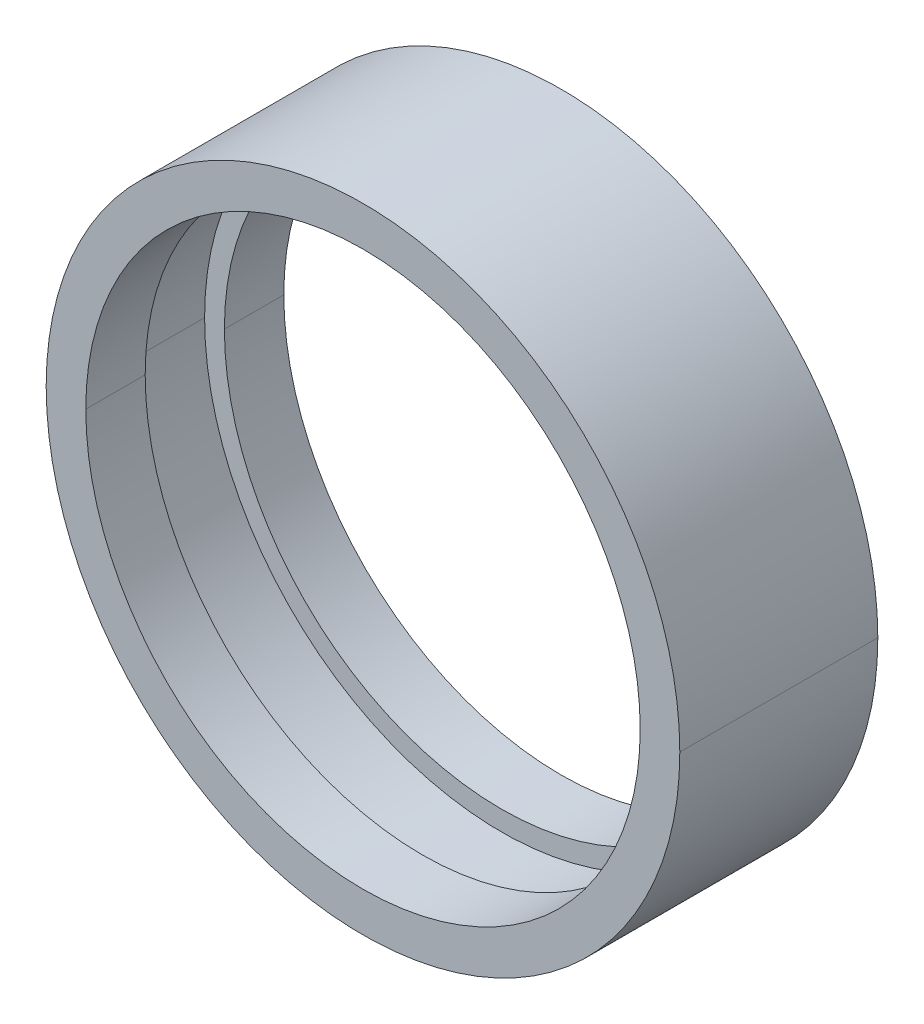
ISO-10303-21;
HEADER;
FILE_DESCRIPTION(('STEP AP214'),'2;1');
FILE_NAME('part.step','',(''),(''),'','','');
FILE_SCHEMA(('AUTOMOTIVE_DESIGN { 1 0 10303 214 1 1 1 1 }'));
ENDSEC;
DATA;
#1=APPLICATION_CONTEXT('core data for automotive mechanical design processes');
#2=APPLICATION_PROTOCOL_DEFINITION('international standard','automotive_design',2000,#1);
#3=PRODUCT_CONTEXT('',#1,'mechanical');
#4=PRODUCT('Part','Part','',(#3));
#5=PRODUCT_RELATED_PRODUCT_CATEGORY('part','',(#4));
#6=PRODUCT_DEFINITION_FORMATION('','',#4);
#7=PRODUCT_DEFINITION_CONTEXT('part definition',#1,'design');
#8=PRODUCT_DEFINITION('design','',#6,#7);
#9=PRODUCT_DEFINITION_SHAPE('','',#8);
#10=(LENGTH_UNIT() NAMED_UNIT(*) SI_UNIT(.MILLI.,.METRE.));
#11=(NAMED_UNIT(*) PLANE_ANGLE_UNIT() SI_UNIT($,.RADIAN.));
#12=(NAMED_UNIT(*) SI_UNIT($,.STERADIAN.) SOLID_ANGLE_UNIT());
#13=UNCERTAINTY_MEASURE_WITH_UNIT(LENGTH_MEASURE(1.E-05),#10,'distance_accuracy_value','');
#14=(GEOMETRIC_REPRESENTATION_CONTEXT(3) GLOBAL_UNCERTAINTY_ASSIGNED_CONTEXT((#13)) GLOBAL_UNIT_ASSIGNED_CONTEXT((#10,
#11,#12)) REPRESENTATION_CONTEXT('',''));
#15=CARTESIAN_POINT('',(0.,0.,0.));
#16=DIRECTION('',(0.,0.,1.));
#17=DIRECTION('',(1.,0.,0.));
#18=AXIS2_PLACEMENT_3D('',#15,#16,#17);
#19=CARTESIAN_POINT('',(0.,0.,0.5));
#20=DIRECTION('',(0.,0.,1.));
#21=DIRECTION('',(1.,0.,0.));
#22=AXIS2_PLACEMENT_3D('',#19,#20,#21);
#23=PLANE('',#22);
#24=CARTESIAN_POINT('',(0.,0.,0.5));
#25=DIRECTION('',(0.,0.,1.));
#26=DIRECTION('',(1.,0.,0.));
#27=AXIS2_PLACEMENT_3D('',#24,#25,#26);
#28=CIRCLE('',#27,3.5);
#29=CARTESIAN_POINT('',(-3.5,0.,0.5));
#30=VERTEX_POINT('',#29);
#31=CARTESIAN_POINT('',(3.5,0.,0.5));
#32=VERTEX_POINT('',#31);
#33=EDGE_CURVE('E113',#30,#32,#28,.T.);
#34=ORIENTED_EDGE('',*,*,#33,.T.);
#35=CARTESIAN_POINT('',(0.,0.,0.5));
#36=DIRECTION('',(0.,0.,1.));
#37=DIRECTION('',(1.,0.,0.));
#38=AXIS2_PLACEMENT_3D('',#35,#36,#37);
#39=CIRCLE('',#38,3.5);
#40=EDGE_CURVE('E161',#32,#30,#39,.T.);
#41=ORIENTED_EDGE('',*,*,#40,.T.);
#42=EDGE_LOOP('',(#34,#41));
#43=FACE_BOUND('',#42,.T.);
#44=CARTESIAN_POINT('',(0.,0.,0.5));
#45=DIRECTION('',(0.,0.,1.));
#46=DIRECTION('',(1.,0.,0.));
#47=AXIS2_PLACEMENT_3D('',#44,#45,#46);
#48=CIRCLE('',#47,3.75);
#49=CARTESIAN_POINT('',(3.75,0.,0.5));
#50=VERTEX_POINT('',#49);
#51=CARTESIAN_POINT('',(-3.75,0.,0.5));
#52=VERTEX_POINT('',#51);
#53=EDGE_CURVE('E11',#50,#52,#48,.T.);
#54=ORIENTED_EDGE('',*,*,#53,.F.);
#55=CARTESIAN_POINT('',(0.,0.,0.5));
#56=DIRECTION('',(0.,0.,1.));
#57=DIRECTION('',(1.,0.,0.));
#58=AXIS2_PLACEMENT_3D('',#55,#56,#57);
#59=CIRCLE('',#58,3.75);
#60=EDGE_CURVE('E129',#52,#50,#59,.T.);
#61=ORIENTED_EDGE('',*,*,#60,.F.);
#62=EDGE_LOOP('',(#54,#61));
#63=FACE_BOUND('',#62,.T.);
#64=ADVANCED_FACE('F17',(#43,#63),#23,.F.);
#65=CARTESIAN_POINT('',(0.,0.,-0.5));
#66=DIRECTION('',(0.,0.,1.));
#67=DIRECTION('',(1.,0.,0.));
#68=AXIS2_PLACEMENT_3D('',#65,#66,#67);
#69=PLANE('',#68);
#70=CARTESIAN_POINT('',(0.,0.,-0.5));
#71=DIRECTION('',(0.,0.,1.));
#72=DIRECTION('',(1.,0.,0.));
#73=AXIS2_PLACEMENT_3D('',#70,#71,#72);
#74=CIRCLE('',#73,3.5);
#75=CARTESIAN_POINT('',(-3.5,0.,-0.5));
#76=VERTEX_POINT('',#75);
#77=CARTESIAN_POINT('',(3.5,0.,-0.5));
#78=VERTEX_POINT('',#77);
#79=EDGE_CURVE('E166',#76,#78,#74,.T.);
#80=ORIENTED_EDGE('',*,*,#79,.F.);
#81=CARTESIAN_POINT('',(0.,0.,-0.5));
#82=DIRECTION('',(0.,0.,1.));
#83=DIRECTION('',(1.,0.,0.));
#84=AXIS2_PLACEMENT_3D('',#81,#82,#83);
#85=CIRCLE('',#84,3.5);
#86=EDGE_CURVE('E149',#78,#76,#85,.T.);
#87=ORIENTED_EDGE('',*,*,#86,.F.);
#88=EDGE_LOOP('',(#80,#87));
#89=FACE_BOUND('',#88,.T.);
#90=CARTESIAN_POINT('',(0.,0.,-0.5));
#91=DIRECTION('',(0.,0.,1.));
#92=DIRECTION('',(1.,0.,0.));
#93=AXIS2_PLACEMENT_3D('',#90,#91,#92);
#94=CIRCLE('',#93,3.75);
#95=CARTESIAN_POINT('',(3.75,0.,-0.5));
#96=VERTEX_POINT('',#95);
#97=CARTESIAN_POINT('',(-3.75,0.,-0.5));
#98=VERTEX_POINT('',#97);
#99=EDGE_CURVE('E27',#96,#98,#94,.T.);
#100=ORIENTED_EDGE('',*,*,#99,.T.);
#101=CARTESIAN_POINT('',(0.,0.,-0.5));
#102=DIRECTION('',(0.,0.,1.));
#103=DIRECTION('',(1.,0.,0.));
#104=AXIS2_PLACEMENT_3D('',#101,#102,#103);
#105=CIRCLE('',#104,3.75);
#106=EDGE_CURVE('E137',#98,#96,#105,.T.);
#107=ORIENTED_EDGE('',*,*,#106,.T.);
#108=EDGE_LOOP('',(#100,#107));
#109=FACE_BOUND('',#108,.T.);
#110=ADVANCED_FACE('F207',(#89,#109),#69,.T.);
#111=CARTESIAN_POINT('',(0.,0.,-0.5));
#112=DIRECTION('',(0.,0.,1.));
#113=DIRECTION('',(1.,0.,0.));
#114=AXIS2_PLACEMENT_3D('',#111,#112,#113);
#115=CYLINDRICAL_SURFACE('',#114,3.75);
#116=DIRECTION('',(0.,0.,1.));
#117=VECTOR('',#116,1.);
#118=CARTESIAN_POINT('',(-3.75,0.,-0.5));
#119=LINE('',#118,#117);
#120=EDGE_CURVE('E141',#98,#52,#119,.T.);
#121=ORIENTED_EDGE('',*,*,#120,.F.);
#122=ORIENTED_EDGE('',*,*,#99,.F.);
#123=DIRECTION('',(0.,0.,1.));
#124=VECTOR('',#123,1.);
#125=CARTESIAN_POINT('',(3.75,0.,-0.5));
#126=LINE('',#125,#124);
#127=EDGE_CURVE('E120',#96,#50,#126,.T.);
#128=ORIENTED_EDGE('',*,*,#127,.T.);
#129=ORIENTED_EDGE('',*,*,#53,.T.);
#130=EDGE_LOOP('',(#121,#122,#128,#129));
#131=FACE_BOUND('',#130,.T.);
#132=ADVANCED_FACE('F205',(#131),#115,.F.);
#133=CARTESIAN_POINT('',(0.,0.,1.25));
#134=DIRECTION('',(0.,0.,-1.));
#135=DIRECTION('',(-1.,0.,0.));
#136=AXIS2_PLACEMENT_3D('',#133,#134,#135);
#137=CYLINDRICAL_SURFACE('',#136,3.5);
#138=DIRECTION('',(0.,0.,-1.));
#139=VECTOR('',#138,1.);
#140=CARTESIAN_POINT('',(3.5,0.,1.25));
#141=LINE('',#140,#139);
#142=CARTESIAN_POINT('',(3.5,0.,1.25));
#143=VERTEX_POINT('',#142);
#144=EDGE_CURVE('E102',#143,#32,#141,.T.);
#145=ORIENTED_EDGE('',*,*,#144,.F.);
#146=CARTESIAN_POINT('',(0.,0.,1.25));
#147=DIRECTION('',(0.,0.,1.));
#148=DIRECTION('',(1.,0.,0.));
#149=AXIS2_PLACEMENT_3D('',#146,#147,#148);
#150=CIRCLE('',#149,3.5);
#151=CARTESIAN_POINT('',(-3.5,0.,1.25));
#152=VERTEX_POINT('',#151);
#153=EDGE_CURVE('E95',#143,#152,#150,.T.);
#154=ORIENTED_EDGE('',*,*,#153,.T.);
#155=DIRECTION('',(0.,0.,-1.));
#156=VECTOR('',#155,1.);
#157=CARTESIAN_POINT('',(-3.5,0.,1.25));
#158=LINE('',#157,#156);
#159=EDGE_CURVE('E99',#152,#30,#158,.T.);
#160=ORIENTED_EDGE('',*,*,#159,.T.);
#161=ORIENTED_EDGE('',*,*,#40,.F.);
#162=EDGE_LOOP('',(#145,#154,#160,#161));
#163=FACE_BOUND('',#162,.T.);
#164=ADVANCED_FACE('F97',(#163),#137,.F.);
#165=CARTESIAN_POINT('',(0.,0.,1.25));
#166=DIRECTION('',(0.,0.,-1.));
#167=DIRECTION('',(-1.,0.,0.));
#168=AXIS2_PLACEMENT_3D('',#165,#166,#167);
#169=CYLINDRICAL_SURFACE('',#168,4.);
#170=DIRECTION('',(0.,0.,-1.));
#171=VECTOR('',#170,1.);
#172=CARTESIAN_POINT('',(4.,0.,1.25));
#173=LINE('',#172,#171);
#174=CARTESIAN_POINT('',(4.,0.,1.25));
#175=VERTEX_POINT('',#174);
#176=CARTESIAN_POINT('',(4.,0.,-1.25));
#177=VERTEX_POINT('',#176);
#178=EDGE_CURVE('E153',#175,#177,#173,.T.);
#179=ORIENTED_EDGE('',*,*,#178,.F.);
#180=CARTESIAN_POINT('',(0.,0.,1.25));
#181=DIRECTION('',(0.,0.,1.));
#182=DIRECTION('',(1.,0.,0.));
#183=AXIS2_PLACEMENT_3D('',#180,#181,#182);
#184=CIRCLE('',#183,4.);
#185=CARTESIAN_POINT('',(-4.,0.,1.25));
#186=VERTEX_POINT('',#185);
#187=EDGE_CURVE('E108',#186,#175,#184,.T.);
#188=ORIENTED_EDGE('',*,*,#187,.F.);
#189=DIRECTION('',(0.,0.,-1.));
#190=VECTOR('',#189,1.);
#191=CARTESIAN_POINT('',(-4.,0.,1.25));
#192=LINE('',#191,#190);
#193=CARTESIAN_POINT('',(-4.,0.,-1.25));
#194=VERTEX_POINT('',#193);
#195=EDGE_CURVE('E169',#186,#194,#192,.T.);
#196=ORIENTED_EDGE('',*,*,#195,.T.);
#197=CARTESIAN_POINT('',(0.,0.,-1.25));
#198=DIRECTION('',(0.,0.,1.));
#199=DIRECTION('',(1.,0.,0.));
#200=AXIS2_PLACEMENT_3D('',#197,#198,#199);
#201=CIRCLE('',#200,4.);
#202=EDGE_CURVE('E107',#194,#177,#201,.T.);
#203=ORIENTED_EDGE('',*,*,#202,.T.);
#204=EDGE_LOOP('',(#179,#188,#196,#203));
#205=FACE_BOUND('',#204,.T.);
#206=ADVANCED_FACE('F178',(#205),#169,.T.);
#207=CARTESIAN_POINT('',(0.,0.,-1.25));
#208=DIRECTION('',(0.,0.,1.));
#209=DIRECTION('',(1.,0.,0.));
#210=AXIS2_PLACEMENT_3D('',#207,#208,#209);
#211=PLANE('',#210);
#212=CARTESIAN_POINT('',(0.,0.,-1.25));
#213=DIRECTION('',(0.,0.,1.));
#214=DIRECTION('',(1.,0.,0.));
#215=AXIS2_PLACEMENT_3D('',#212,#213,#214);
#216=CIRCLE('',#215,3.5);
#217=CARTESIAN_POINT('',(-3.5,0.,-1.25));
#218=VERTEX_POINT('',#217);
#219=CARTESIAN_POINT('',(3.5,0.,-1.25));
#220=VERTEX_POINT('',#219);
#221=EDGE_CURVE('E142',#218,#220,#216,.T.);
#222=ORIENTED_EDGE('',*,*,#221,.T.);
#223=CARTESIAN_POINT('',(0.,0.,-1.25));
#224=DIRECTION('',(0.,0.,1.));
#225=DIRECTION('',(1.,0.,0.));
#226=AXIS2_PLACEMENT_3D('',#223,#224,#225);
#227=CIRCLE('',#226,3.5);
#228=EDGE_CURVE('E40',#220,#218,#227,.T.);
#229=ORIENTED_EDGE('',*,*,#228,.T.);
#230=EDGE_LOOP('',(#222,#229));
#231=FACE_BOUND('',#230,.T.);
#232=ORIENTED_EDGE('',*,*,#202,.F.);
#233=CARTESIAN_POINT('',(0.,0.,-1.25));
#234=DIRECTION('',(0.,0.,1.));
#235=DIRECTION('',(1.,0.,0.));
#236=AXIS2_PLACEMENT_3D('',#233,#234,#235);
#237=CIRCLE('',#236,4.);
#238=EDGE_CURVE('E133',#177,#194,#237,.T.);
#239=ORIENTED_EDGE('',*,*,#238,.F.);
#240=EDGE_LOOP('',(#232,#239));
#241=FACE_BOUND('',#240,.T.);
#242=ADVANCED_FACE('F183',(#231,#241),#211,.F.);
#243=CARTESIAN_POINT('',(0.,0.,1.25));
#244=DIRECTION('',(0.,0.,1.));
#245=DIRECTION('',(1.,0.,0.));
#246=AXIS2_PLACEMENT_3D('',#243,#244,#245);
#247=PLANE('',#246);
#248=CARTESIAN_POINT('',(0.,0.,1.25));
#249=DIRECTION('',(0.,0.,1.));
#250=DIRECTION('',(1.,0.,0.));
#251=AXIS2_PLACEMENT_3D('',#248,#249,#250);
#252=CIRCLE('',#251,3.5);
#253=EDGE_CURVE('E111',#152,#143,#252,.T.);
#254=ORIENTED_EDGE('',*,*,#253,.F.);
#255=ORIENTED_EDGE('',*,*,#153,.F.);
#256=EDGE_LOOP('',(#254,#255));
#257=FACE_BOUND('',#256,.T.);
#258=ORIENTED_EDGE('',*,*,#187,.T.);
#259=CARTESIAN_POINT('',(0.,0.,1.25));
#260=DIRECTION('',(0.,0.,1.));
#261=DIRECTION('',(1.,0.,0.));
#262=AXIS2_PLACEMENT_3D('',#259,#260,#261);
#263=CIRCLE('',#262,4.);
#264=EDGE_CURVE('E115',#175,#186,#263,.T.);
#265=ORIENTED_EDGE('',*,*,#264,.T.);
#266=EDGE_LOOP('',(#258,#265));
#267=FACE_BOUND('',#266,.T.);
#268=ADVANCED_FACE('F117',(#257,#267),#247,.T.);
#269=CARTESIAN_POINT('',(0.,0.,1.25));
#270=DIRECTION('',(0.,0.,-1.));
#271=DIRECTION('',(-1.,0.,0.));
#272=AXIS2_PLACEMENT_3D('',#269,#270,#271);
#273=CYLINDRICAL_SURFACE('',#272,3.5);
#274=DIRECTION('',(0.,0.,-1.));
#275=VECTOR('',#274,1.);
#276=CARTESIAN_POINT('',(3.5,0.,1.25));
#277=LINE('',#276,#275);
#278=EDGE_CURVE('E146',#78,#220,#277,.T.);
#279=ORIENTED_EDGE('',*,*,#278,.F.);
#280=ORIENTED_EDGE('',*,*,#86,.T.);
#281=DIRECTION('',(0.,0.,-1.));
#282=VECTOR('',#281,1.);
#283=CARTESIAN_POINT('',(-3.5,0.,1.25));
#284=LINE('',#283,#282);
#285=EDGE_CURVE('E145',#76,#218,#284,.T.);
#286=ORIENTED_EDGE('',*,*,#285,.T.);
#287=ORIENTED_EDGE('',*,*,#228,.F.);
#288=EDGE_LOOP('',(#279,#280,#286,#287));
#289=FACE_BOUND('',#288,.T.);
#290=ADVANCED_FACE('F232',(#289),#273,.F.);
#291=CARTESIAN_POINT('',(0.,0.,1.25));
#292=DIRECTION('',(0.,0.,-1.));
#293=DIRECTION('',(-1.,0.,0.));
#294=AXIS2_PLACEMENT_3D('',#291,#292,#293);
#295=CYLINDRICAL_SURFACE('',#294,3.5);
#296=ORIENTED_EDGE('',*,*,#79,.T.);
#297=ORIENTED_EDGE('',*,*,#278,.T.);
#298=ORIENTED_EDGE('',*,*,#221,.F.);
#299=ORIENTED_EDGE('',*,*,#285,.F.);
#300=EDGE_LOOP('',(#296,#297,#298,#299));
#301=FACE_BOUND('',#300,.T.);
#302=ADVANCED_FACE('F224',(#301),#295,.F.);
#303=CARTESIAN_POINT('',(0.,0.,1.25));
#304=DIRECTION('',(0.,0.,-1.));
#305=DIRECTION('',(-1.,0.,0.));
#306=AXIS2_PLACEMENT_3D('',#303,#304,#305);
#307=CYLINDRICAL_SURFACE('',#306,4.);
#308=ORIENTED_EDGE('',*,*,#264,.F.);
#309=ORIENTED_EDGE('',*,*,#178,.T.);
#310=ORIENTED_EDGE('',*,*,#238,.T.);
#311=ORIENTED_EDGE('',*,*,#195,.F.);
#312=EDGE_LOOP('',(#308,#309,#310,#311));
#313=FACE_BOUND('',#312,.T.);
#314=ADVANCED_FACE('F186',(#313),#307,.T.);
#315=CARTESIAN_POINT('',(0.,0.,1.25));
#316=DIRECTION('',(0.,0.,-1.));
#317=DIRECTION('',(-1.,0.,0.));
#318=AXIS2_PLACEMENT_3D('',#315,#316,#317);
#319=CYLINDRICAL_SURFACE('',#318,3.5);
#320=ORIENTED_EDGE('',*,*,#253,.T.);
#321=ORIENTED_EDGE('',*,*,#144,.T.);
#322=ORIENTED_EDGE('',*,*,#33,.F.);
#323=ORIENTED_EDGE('',*,*,#159,.F.);
#324=EDGE_LOOP('',(#320,#321,#322,#323));
#325=FACE_BOUND('',#324,.T.);
#326=ADVANCED_FACE('F19',(#325),#319,.F.);
#327=CARTESIAN_POINT('',(0.,0.,-0.5));
#328=DIRECTION('',(0.,0.,1.));
#329=DIRECTION('',(1.,0.,0.));
#330=AXIS2_PLACEMENT_3D('',#327,#328,#329);
#331=CYLINDRICAL_SURFACE('',#330,3.75);
#332=ORIENTED_EDGE('',*,*,#106,.F.);
#333=ORIENTED_EDGE('',*,*,#120,.T.);
#334=ORIENTED_EDGE('',*,*,#60,.T.);
#335=ORIENTED_EDGE('',*,*,#127,.F.);
#336=EDGE_LOOP('',(#332,#333,#334,#335));
#337=FACE_BOUND('',#336,.T.);
#338=ADVANCED_FACE('F201',(#337),#331,.F.);
#339=CLOSED_SHELL('',(#64,#110,#132,#164,#206,#242,#268,#290,#302,#314,#326,#338));
#340=MANIFOLD_SOLID_BREP('B1',#339);
#341=ADVANCED_BREP_SHAPE_REPRESENTATION('',(#18,#340),#14);
#342=SHAPE_DEFINITION_REPRESENTATION(#9,#341);
ENDSEC;
END-ISO-10303-21;
